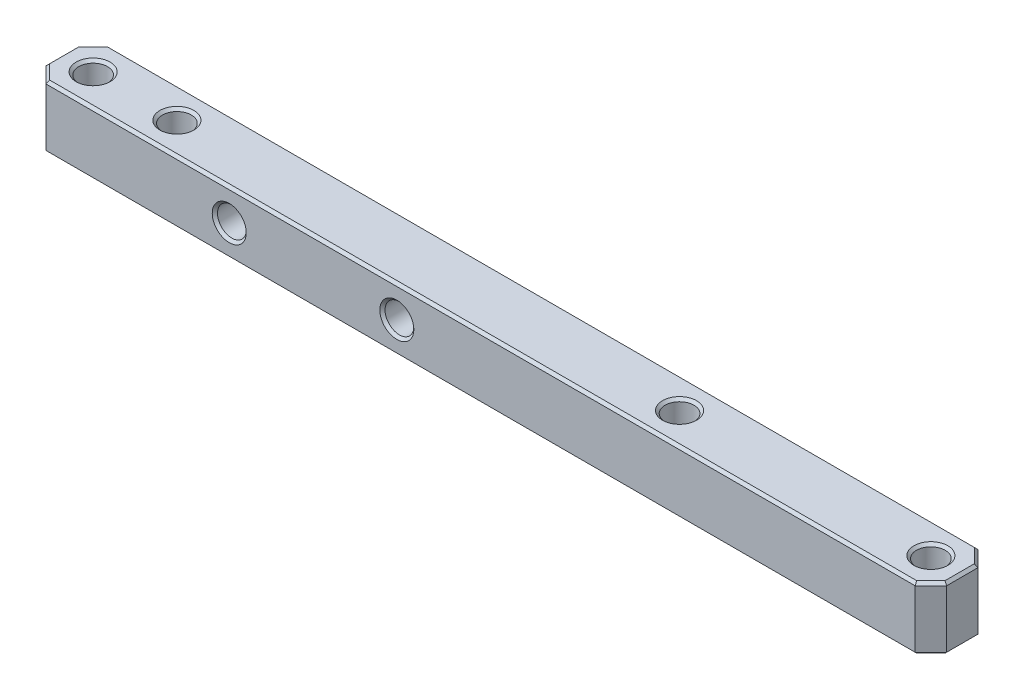
ISO-10303-21;
HEADER;
FILE_DESCRIPTION(('STEP AP214'),'2;1');
FILE_NAME('part.step','',(''),(''),'','','');
FILE_SCHEMA(('AUTOMOTIVE_DESIGN { 1 0 10303 214 1 1 1 1 }'));
ENDSEC;
DATA;
#1=APPLICATION_CONTEXT('core data for automotive mechanical design processes');
#2=APPLICATION_PROTOCOL_DEFINITION('international standard','automotive_design',2000,#1);
#3=PRODUCT_CONTEXT('',#1,'mechanical');
#4=PRODUCT('Part','Part','',(#3));
#5=PRODUCT_RELATED_PRODUCT_CATEGORY('part','',(#4));
#6=PRODUCT_DEFINITION_FORMATION('','',#4);
#7=PRODUCT_DEFINITION_CONTEXT('part definition',#1,'design');
#8=PRODUCT_DEFINITION('design','',#6,#7);
#9=PRODUCT_DEFINITION_SHAPE('','',#8);
#10=(LENGTH_UNIT() NAMED_UNIT(*) SI_UNIT(.MILLI.,.METRE.));
#11=(NAMED_UNIT(*) PLANE_ANGLE_UNIT() SI_UNIT($,.RADIAN.));
#12=(NAMED_UNIT(*) SI_UNIT($,.STERADIAN.) SOLID_ANGLE_UNIT());
#13=UNCERTAINTY_MEASURE_WITH_UNIT(LENGTH_MEASURE(1.E-05),#10,'distance_accuracy_value','');
#14=(GEOMETRIC_REPRESENTATION_CONTEXT(3) GLOBAL_UNCERTAINTY_ASSIGNED_CONTEXT((#13)) GLOBAL_UNIT_ASSIGNED_CONTEXT((#10,
#11,#12)) REPRESENTATION_CONTEXT('',''));
#15=CARTESIAN_POINT('',(0.,0.,0.));
#16=DIRECTION('',(0.,0.,1.));
#17=DIRECTION('',(1.,0.,0.));
#18=AXIS2_PLACEMENT_3D('',#15,#16,#17);
#19=CARTESIAN_POINT('',(0.,9.525,0.));
#20=DIRECTION('',(0.,1.,0.));
#21=DIRECTION('',(0.,0.,1.));
#22=AXIS2_PLACEMENT_3D('',#19,#20,#21);
#23=PLANE('',#22);
#24=CARTESIAN_POINT('',(88.9,9.525,0.));
#25=DIRECTION('',(0.,1.,0.));
#26=DIRECTION('',(0.,0.,1.));
#27=AXIS2_PLACEMENT_3D('',#24,#25,#26);
#28=CIRCLE('',#27,2.57968750000007);
#29=CARTESIAN_POINT('',(88.9,9.525,2.57968750000007));
#30=VERTEX_POINT('',#29);
#31=EDGE_CURVE('E11',#30,#30,#28,.F.);
#32=ORIENTED_EDGE('',*,*,#31,.T.);
#33=EDGE_LOOP('',(#32));
#34=FACE_BOUND('',#33,.T.);
#35=CARTESIAN_POINT('',(12.7,9.525,0.));
#36=DIRECTION('',(0.,1.,0.));
#37=DIRECTION('',(0.,0.,1.));
#38=AXIS2_PLACEMENT_3D('',#35,#36,#37);
#39=CIRCLE('',#38,2.57968750000009);
#40=CARTESIAN_POINT('',(12.7,9.525,2.57968750000009));
#41=VERTEX_POINT('',#40);
#42=EDGE_CURVE('E47',#41,#41,#39,.F.);
#43=ORIENTED_EDGE('',*,*,#42,.T.);
#44=EDGE_LOOP('',(#43));
#45=FACE_BOUND('',#44,.T.);
#46=DIRECTION('',(1.,0.,0.));
#47=VECTOR('',#46,1.);
#48=CARTESIAN_POINT('',(129.38125,9.525,4.36562499999998));
#49=LINE('',#48,#47);
#50=CARTESIAN_POINT('',(-2.21685899243314,9.525,4.36562499999998));
#51=VERTEX_POINT('',#50);
#52=CARTESIAN_POINT('',(129.216858992433,9.525,4.36562499999998));
#53=VERTEX_POINT('',#52);
#54=EDGE_CURVE('E55',#51,#53,#49,.T.);
#55=ORIENTED_EDGE('',*,*,#54,.T.);
#56=DIRECTION('',(0.70710678118655,0.,-0.707106781186545));
#57=VECTOR('',#56,1.);
#58=CARTESIAN_POINT('',(66.7912419962162,9.525,66.7912419962166));
#59=LINE('',#58,#57);
#60=CARTESIAN_POINT('',(131.365625,9.525,2.21685899243319));
#61=VERTEX_POINT('',#60);
#62=EDGE_CURVE('E339',#53,#61,#59,.T.);
#63=ORIENTED_EDGE('',*,*,#62,.T.);
#64=DIRECTION('',(0.,0.,-1.));
#65=VECTOR('',#64,1.);
#66=CARTESIAN_POINT('',(131.365625,9.525,-2.38125));
#67=LINE('',#66,#65);
#68=CARTESIAN_POINT('',(131.365625,9.525,-2.21685899243322));
#69=VERTEX_POINT('',#68);
#70=EDGE_CURVE('E327',#61,#69,#67,.T.);
#71=ORIENTED_EDGE('',*,*,#70,.T.);
#72=DIRECTION('',(-0.707106781186548,0.,-0.707106781186547));
#73=VECTOR('',#72,1.);
#74=CARTESIAN_POINT('',(66.7912419962166,9.525,-66.7912419962166));
#75=LINE('',#74,#73);
#76=CARTESIAN_POINT('',(129.216858992433,9.525,-4.36562499999999));
#77=VERTEX_POINT('',#76);
#78=EDGE_CURVE('E329',#69,#77,#75,.T.);
#79=ORIENTED_EDGE('',*,*,#78,.T.);
#80=DIRECTION('',(-1.,0.,0.));
#81=VECTOR('',#80,1.);
#82=CARTESIAN_POINT('',(-2.38125,9.525,-4.36562499999998));
#83=LINE('',#82,#81);
#84=CARTESIAN_POINT('',(-2.21685899243317,9.525,-4.36562499999998));
#85=VERTEX_POINT('',#84);
#86=EDGE_CURVE('E331',#77,#85,#83,.T.);
#87=ORIENTED_EDGE('',*,*,#86,.T.);
#88=DIRECTION('',(-0.70710678118655,0.,0.707106781186545));
#89=VECTOR('',#88,1.);
#90=CARTESIAN_POINT('',(-3.29124199621657,9.525,-3.29124199621659));
#91=LINE('',#90,#89);
#92=CARTESIAN_POINT('',(-4.36562499999998,9.525,-2.21685899243318));
#93=VERTEX_POINT('',#92);
#94=EDGE_CURVE('E333',#85,#93,#91,.T.);
#95=ORIENTED_EDGE('',*,*,#94,.T.);
#96=DIRECTION('',(0.,0.,1.));
#97=VECTOR('',#96,1.);
#98=CARTESIAN_POINT('',(-4.36562499999998,9.525,2.38124999999997));
#99=LINE('',#98,#97);
#100=CARTESIAN_POINT('',(-4.36562499999998,9.525,2.21685899243314));
#101=VERTEX_POINT('',#100);
#102=EDGE_CURVE('E335',#93,#101,#99,.T.);
#103=ORIENTED_EDGE('',*,*,#102,.T.);
#104=DIRECTION('',(0.707106781186548,0.,0.707106781186547));
#105=VECTOR('',#104,1.);
#106=CARTESIAN_POINT('',(-3.29124199621656,9.525,3.29124199621656));
#107=LINE('',#106,#105);
#108=EDGE_CURVE('E60',#101,#51,#107,.T.);
#109=ORIENTED_EDGE('',*,*,#108,.T.);
#110=EDGE_LOOP('',(#55,#63,#71,#79,#87,#95,#103,#109));
#111=FACE_BOUND('',#110,.T.);
#112=CARTESIAN_POINT('',(0.,9.525,0.));
#113=DIRECTION('',(0.,1.,0.));
#114=DIRECTION('',(0.,0.,1.));
#115=AXIS2_PLACEMENT_3D('',#112,#113,#114);
#116=CIRCLE('',#115,2.57968750000007);
#117=CARTESIAN_POINT('',(0.,9.525,2.57968750000007));
#118=VERTEX_POINT('',#117);
#119=EDGE_CURVE('E324',#118,#118,#116,.F.);
#120=ORIENTED_EDGE('',*,*,#119,.T.);
#121=EDGE_LOOP('',(#120));
#122=FACE_BOUND('',#121,.T.);
#123=CARTESIAN_POINT('',(127.,9.525,0.));
#124=DIRECTION('',(0.,1.,0.));
#125=DIRECTION('',(0.,0.,1.));
#126=AXIS2_PLACEMENT_3D('',#123,#124,#125);
#127=CIRCLE('',#126,2.57968750000007);
#128=CARTESIAN_POINT('',(127.,9.525,2.57968750000007));
#129=VERTEX_POINT('',#128);
#130=EDGE_CURVE('E321',#129,#129,#127,.F.);
#131=ORIENTED_EDGE('',*,*,#130,.T.);
#132=EDGE_LOOP('',(#131));
#133=FACE_BOUND('',#132,.T.);
#134=ADVANCED_FACE('F37',(#34,#45,#111,#122,#133),#23,.T.);
#135=CARTESIAN_POINT('',(0.,0.,0.));
#136=DIRECTION('',(0.,1.,0.));
#137=DIRECTION('',(0.,0.,1.));
#138=AXIS2_PLACEMENT_3D('',#135,#136,#137);
#139=PLANE('',#138);
#140=CARTESIAN_POINT('',(88.9,0.,0.));
#141=DIRECTION('',(0.,1.,0.));
#142=DIRECTION('',(0.,0.,1.));
#143=AXIS2_PLACEMENT_3D('',#140,#141,#142);
#144=CIRCLE('',#143,2.57968749999994);
#145=CARTESIAN_POINT('',(88.9,0.,2.57968749999994));
#146=VERTEX_POINT('',#145);
#147=EDGE_CURVE('E274',#146,#146,#144,.T.);
#148=ORIENTED_EDGE('',*,*,#147,.T.);
#149=EDGE_LOOP('',(#148));
#150=FACE_BOUND('',#149,.T.);
#151=CARTESIAN_POINT('',(127.,0.,0.));
#152=DIRECTION('',(0.,1.,0.));
#153=DIRECTION('',(0.,0.,1.));
#154=AXIS2_PLACEMENT_3D('',#151,#152,#153);
#155=CIRCLE('',#154,2.57968749999994);
#156=CARTESIAN_POINT('',(127.,0.,2.57968749999994));
#157=VERTEX_POINT('',#156);
#158=EDGE_CURVE('E271',#157,#157,#155,.T.);
#159=ORIENTED_EDGE('',*,*,#158,.T.);
#160=EDGE_LOOP('',(#159));
#161=FACE_BOUND('',#160,.T.);
#162=CARTESIAN_POINT('',(12.7,0.,0.));
#163=DIRECTION('',(0.,1.,0.));
#164=DIRECTION('',(0.,0.,1.));
#165=AXIS2_PLACEMENT_3D('',#162,#163,#164);
#166=CIRCLE('',#165,2.57968749999993);
#167=CARTESIAN_POINT('',(12.7,0.,2.57968749999993));
#168=VERTEX_POINT('',#167);
#169=EDGE_CURVE('E268',#168,#168,#166,.T.);
#170=ORIENTED_EDGE('',*,*,#169,.T.);
#171=EDGE_LOOP('',(#170));
#172=FACE_BOUND('',#171,.T.);
#173=CARTESIAN_POINT('',(0.,0.,0.));
#174=DIRECTION('',(0.,1.,0.));
#175=DIRECTION('',(0.,0.,1.));
#176=AXIS2_PLACEMENT_3D('',#173,#174,#175);
#177=CIRCLE('',#176,2.57968749999994);
#178=CARTESIAN_POINT('',(0.,0.,2.57968749999994));
#179=VERTEX_POINT('',#178);
#180=EDGE_CURVE('E265',#179,#179,#177,.T.);
#181=ORIENTED_EDGE('',*,*,#180,.T.);
#182=EDGE_LOOP('',(#181));
#183=FACE_BOUND('',#182,.T.);
#184=DIRECTION('',(0.,0.,-1.));
#185=VECTOR('',#184,1.);
#186=CARTESIAN_POINT('',(-4.36562499999998,0.,0.));
#187=LINE('',#186,#185);
#188=CARTESIAN_POINT('',(-4.36562499999998,0.,2.21685899243314));
#189=VERTEX_POINT('',#188);
#190=CARTESIAN_POINT('',(-4.36562499999998,0.,-2.21685899243319));
#191=VERTEX_POINT('',#190);
#192=EDGE_CURVE('E255',#189,#191,#187,.T.);
#193=ORIENTED_EDGE('',*,*,#192,.T.);
#194=DIRECTION('',(0.70710678118655,0.,-0.707106781186545));
#195=VECTOR('',#194,1.);
#196=CARTESIAN_POINT('',(-2.10061699621658,0.,-4.48186699621658));
#197=LINE('',#196,#195);
#198=CARTESIAN_POINT('',(-2.21685899243317,0.,-4.36562499999998));
#199=VERTEX_POINT('',#198);
#200=EDGE_CURVE('E257',#191,#199,#197,.T.);
#201=ORIENTED_EDGE('',*,*,#200,.T.);
#202=DIRECTION('',(1.,0.,0.));
#203=VECTOR('',#202,1.);
#204=CARTESIAN_POINT('',(0.,0.,-4.36562499999998));
#205=LINE('',#204,#203);
#206=CARTESIAN_POINT('',(129.216858992433,0.,-4.36562499999998));
#207=VERTEX_POINT('',#206);
#208=EDGE_CURVE('E892',#199,#207,#205,.T.);
#209=ORIENTED_EDGE('',*,*,#208,.T.);
#210=DIRECTION('',(0.707106781186548,0.,0.707106781186547));
#211=VECTOR('',#210,1.);
#212=CARTESIAN_POINT('',(131.481866996217,0.,-2.10061699621659));
#213=LINE('',#212,#211);
#214=CARTESIAN_POINT('',(131.365625,0.,-2.21685899243322));
#215=VERTEX_POINT('',#214);
#216=EDGE_CURVE('E895',#207,#215,#213,.T.);
#217=ORIENTED_EDGE('',*,*,#216,.T.);
#218=DIRECTION('',(0.,0.,1.));
#219=VECTOR('',#218,1.);
#220=CARTESIAN_POINT('',(131.365625,0.,0.));
#221=LINE('',#220,#219);
#222=CARTESIAN_POINT('',(131.365625,0.,2.21685899243319));
#223=VERTEX_POINT('',#222);
#224=EDGE_CURVE('E898',#215,#223,#221,.T.);
#225=ORIENTED_EDGE('',*,*,#224,.T.);
#226=DIRECTION('',(-0.70710678118655,0.,0.707106781186545));
#227=VECTOR('',#226,1.);
#228=CARTESIAN_POINT('',(129.100616996217,0.,4.48186699621658));
#229=LINE('',#228,#227);
#230=CARTESIAN_POINT('',(129.216858992433,0.,4.36562499999998));
#231=VERTEX_POINT('',#230);
#232=EDGE_CURVE('E259',#223,#231,#229,.T.);
#233=ORIENTED_EDGE('',*,*,#232,.T.);
#234=DIRECTION('',(-1.,0.,0.));
#235=VECTOR('',#234,1.);
#236=CARTESIAN_POINT('',(0.,0.,4.36562499999998));
#237=LINE('',#236,#235);
#238=CARTESIAN_POINT('',(-2.21685899243314,0.,4.36562499999998));
#239=VERTEX_POINT('',#238);
#240=EDGE_CURVE('E191',#231,#239,#237,.T.);
#241=ORIENTED_EDGE('',*,*,#240,.T.);
#242=DIRECTION('',(-0.707106781186548,0.,-0.707106781186547));
#243=VECTOR('',#242,1.);
#244=CARTESIAN_POINT('',(-4.48186699621658,0.,2.10061699621655));
#245=LINE('',#244,#243);
#246=EDGE_CURVE('E252',#239,#189,#245,.T.);
#247=ORIENTED_EDGE('',*,*,#246,.T.);
#248=EDGE_LOOP('',(#193,#201,#209,#217,#225,#233,#241,#247));
#249=FACE_BOUND('',#248,.T.);
#250=ADVANCED_FACE('F369',(#150,#161,#172,#183,#249),#139,.F.);
#251=CARTESIAN_POINT('',(-4.7625,9.525,-4.7625));
#252=DIRECTION('',(1.,0.,0.));
#253=DIRECTION('',(0.,0.,-1.));
#254=AXIS2_PLACEMENT_3D('',#251,#252,#253);
#255=PLANE('',#254);
#256=DIRECTION('',(0.,-1.,0.));
#257=VECTOR('',#256,1.);
#258=CARTESIAN_POINT('',(-4.7625,9.525,-2.38125000000001));
#259=LINE('',#258,#257);
#260=CARTESIAN_POINT('',(-4.7625,9.12812500000001,-2.38125000000001));
#261=VERTEX_POINT('',#260);
#262=CARTESIAN_POINT('',(-4.7625,0.396875000000005,-2.38125000000001));
#263=VERTEX_POINT('',#262);
#264=EDGE_CURVE('E923',#261,#263,#259,.T.);
#265=ORIENTED_EDGE('',*,*,#264,.T.);
#266=DIRECTION('',(0.,0.,1.));
#267=VECTOR('',#266,1.);
#268=CARTESIAN_POINT('',(-4.7625,0.396875000000005,-4.7625));
#269=LINE('',#268,#267);
#270=CARTESIAN_POINT('',(-4.7625,0.396875000000005,2.38124999999997));
#271=VERTEX_POINT('',#270);
#272=EDGE_CURVE('E308',#263,#271,#269,.T.);
#273=ORIENTED_EDGE('',*,*,#272,.T.);
#274=DIRECTION('',(0.,1.,0.));
#275=VECTOR('',#274,1.);
#276=CARTESIAN_POINT('',(-4.7625,9.525,2.38124999999997));
#277=LINE('',#276,#275);
#278=CARTESIAN_POINT('',(-4.7625,9.12812500000001,2.38124999999997));
#279=VERTEX_POINT('',#278);
#280=EDGE_CURVE('E176',#271,#279,#277,.T.);
#281=ORIENTED_EDGE('',*,*,#280,.T.);
#282=DIRECTION('',(0.,0.,-1.));
#283=VECTOR('',#282,1.);
#284=CARTESIAN_POINT('',(-4.7625,9.12812500000001,-2.38125000000002));
#285=LINE('',#284,#283);
#286=EDGE_CURVE('E306',#279,#261,#285,.T.);
#287=ORIENTED_EDGE('',*,*,#286,.T.);
#288=EDGE_LOOP('',(#265,#273,#281,#287));
#289=FACE_BOUND('',#288,.T.);
#290=ADVANCED_FACE('F375',(#289),#255,.F.);
#291=CARTESIAN_POINT('',(-4.7625,9.525,4.7625));
#292=DIRECTION('',(0.,0.,-1.));
#293=DIRECTION('',(-1.,0.,0.));
#294=AXIS2_PLACEMENT_3D('',#291,#292,#293);
#295=PLANE('',#294);
#296=CARTESIAN_POINT('',(25.4,4.7625,4.7625));
#297=DIRECTION('',(0.,0.,-1.));
#298=DIRECTION('',(-1.,0.,0.));
#299=AXIS2_PLACEMENT_3D('',#296,#297,#298);
#300=CIRCLE('',#299,2.57968749999994);
#301=CARTESIAN_POINT('',(22.8203125000001,4.7625,4.7625));
#302=VERTEX_POINT('',#301);
#303=EDGE_CURVE('E928',#302,#302,#300,.T.);
#304=ORIENTED_EDGE('',*,*,#303,.T.);
#305=EDGE_LOOP('',(#304));
#306=FACE_BOUND('',#305,.T.);
#307=CARTESIAN_POINT('',(50.8,4.7625,4.7625));
#308=DIRECTION('',(0.,0.,-1.));
#309=DIRECTION('',(-1.,0.,0.));
#310=AXIS2_PLACEMENT_3D('',#307,#308,#309);
#311=CIRCLE('',#310,2.57968749999996);
#312=CARTESIAN_POINT('',(48.2203125,4.7625,4.7625));
#313=VERTEX_POINT('',#312);
#314=EDGE_CURVE('E164',#313,#313,#311,.T.);
#315=ORIENTED_EDGE('',*,*,#314,.T.);
#316=EDGE_LOOP('',(#315));
#317=FACE_BOUND('',#316,.T.);
#318=DIRECTION('',(0.,-1.,0.));
#319=VECTOR('',#318,1.);
#320=CARTESIAN_POINT('',(-2.38124999999997,9.525,4.7625));
#321=LINE('',#320,#319);
#322=CARTESIAN_POINT('',(-2.38124999999997,9.12812500000001,4.7625));
#323=VERTEX_POINT('',#322);
#324=CARTESIAN_POINT('',(-2.38124999999997,0.396875000000005,4.7625));
#325=VERTEX_POINT('',#324);
#326=EDGE_CURVE('E159',#323,#325,#321,.T.);
#327=ORIENTED_EDGE('',*,*,#326,.T.);
#328=DIRECTION('',(1.,0.,0.));
#329=VECTOR('',#328,1.);
#330=CARTESIAN_POINT('',(-4.7625,0.396875000000005,4.7625));
#331=LINE('',#330,#329);
#332=CARTESIAN_POINT('',(129.38125,0.396875000000008,4.7625));
#333=VERTEX_POINT('',#332);
#334=EDGE_CURVE('E154',#325,#333,#331,.T.);
#335=ORIENTED_EDGE('',*,*,#334,.T.);
#336=DIRECTION('',(0.,1.,0.));
#337=VECTOR('',#336,1.);
#338=CARTESIAN_POINT('',(129.38125,9.525,4.7625));
#339=LINE('',#338,#337);
#340=CARTESIAN_POINT('',(129.38125,9.12812500000001,4.7625));
#341=VERTEX_POINT('',#340);
#342=EDGE_CURVE('E157',#333,#341,#339,.T.);
#343=ORIENTED_EDGE('',*,*,#342,.T.);
#344=DIRECTION('',(-1.,0.,0.));
#345=VECTOR('',#344,1.);
#346=CARTESIAN_POINT('',(-2.38124999999997,9.12812500000001,4.7625));
#347=LINE('',#346,#345);
#348=EDGE_CURVE('E165',#341,#323,#347,.T.);
#349=ORIENTED_EDGE('',*,*,#348,.T.);
#350=EDGE_LOOP('',(#327,#335,#343,#349));
#351=FACE_BOUND('',#350,.T.);
#352=ADVANCED_FACE('F156',(#306,#317,#351),#295,.F.);
#353=CARTESIAN_POINT('',(131.7625,9.525,-4.7625));
#354=DIRECTION('',(-1.,0.,0.));
#355=DIRECTION('',(0.,0.,1.));
#356=AXIS2_PLACEMENT_3D('',#353,#354,#355);
#357=PLANE('',#356);
#358=DIRECTION('',(0.,-1.,0.));
#359=VECTOR('',#358,1.);
#360=CARTESIAN_POINT('',(131.7625,9.525,2.38125000000001));
#361=LINE('',#360,#359);
#362=CARTESIAN_POINT('',(131.7625,9.12812500000001,2.38125000000001));
#363=VERTEX_POINT('',#362);
#364=CARTESIAN_POINT('',(131.7625,0.396875000000005,2.38125000000001));
#365=VERTEX_POINT('',#364);
#366=EDGE_CURVE('E912',#363,#365,#361,.T.);
#367=ORIENTED_EDGE('',*,*,#366,.T.);
#368=DIRECTION('',(0.,0.,-1.));
#369=VECTOR('',#368,1.);
#370=CARTESIAN_POINT('',(131.7625,0.396875000000005,-4.7625));
#371=LINE('',#370,#369);
#372=CARTESIAN_POINT('',(131.7625,0.396874999999998,-2.38125));
#373=VERTEX_POINT('',#372);
#374=EDGE_CURVE('E315',#365,#373,#371,.T.);
#375=ORIENTED_EDGE('',*,*,#374,.T.);
#376=DIRECTION('',(0.,1.,0.));
#377=VECTOR('',#376,1.);
#378=CARTESIAN_POINT('',(131.7625,9.525,-2.38125));
#379=LINE('',#378,#377);
#380=CARTESIAN_POINT('',(131.7625,9.12812500000001,-2.38125));
#381=VERTEX_POINT('',#380);
#382=EDGE_CURVE('E910',#373,#381,#379,.T.);
#383=ORIENTED_EDGE('',*,*,#382,.T.);
#384=DIRECTION('',(0.,0.,1.));
#385=VECTOR('',#384,1.);
#386=CARTESIAN_POINT('',(131.7625,9.12812500000001,2.38125000000001));
#387=LINE('',#386,#385);
#388=EDGE_CURVE('E188',#381,#363,#387,.T.);
#389=ORIENTED_EDGE('',*,*,#388,.T.);
#390=EDGE_LOOP('',(#367,#375,#383,#389));
#391=FACE_BOUND('',#390,.T.);
#392=ADVANCED_FACE('F381',(#391),#357,.F.);
#393=CARTESIAN_POINT('',(-4.7625,9.525,-4.7625));
#394=DIRECTION('',(0.,0.,1.));
#395=DIRECTION('',(1.,0.,0.));
#396=AXIS2_PLACEMENT_3D('',#393,#394,#395);
#397=PLANE('',#396);
#398=CARTESIAN_POINT('',(25.4,4.7625,-4.7625));
#399=DIRECTION('',(0.,0.,1.));
#400=DIRECTION('',(1.,0.,0.));
#401=AXIS2_PLACEMENT_3D('',#398,#399,#400);
#402=CIRCLE('',#401,2.5796875);
#403=CARTESIAN_POINT('',(27.9796875,4.7625,-4.7625));
#404=VERTEX_POINT('',#403);
#405=EDGE_CURVE('E943',#404,#404,#402,.T.);
#406=ORIENTED_EDGE('',*,*,#405,.T.);
#407=EDGE_LOOP('',(#406));
#408=FACE_BOUND('',#407,.T.);
#409=CARTESIAN_POINT('',(50.8,4.7625,-4.7625));
#410=DIRECTION('',(0.,0.,1.));
#411=DIRECTION('',(1.,0.,0.));
#412=AXIS2_PLACEMENT_3D('',#409,#410,#411);
#413=CIRCLE('',#412,2.57968749999996);
#414=CARTESIAN_POINT('',(53.3796875,4.7625,-4.7625));
#415=VERTEX_POINT('',#414);
#416=EDGE_CURVE('E940',#415,#415,#413,.T.);
#417=ORIENTED_EDGE('',*,*,#416,.T.);
#418=EDGE_LOOP('',(#417));
#419=FACE_BOUND('',#418,.T.);
#420=DIRECTION('',(0.,-1.,0.));
#421=VECTOR('',#420,1.);
#422=CARTESIAN_POINT('',(129.38125,9.525,-4.7625));
#423=LINE('',#422,#421);
#424=CARTESIAN_POINT('',(129.38125,9.12812500000002,-4.7625));
#425=VERTEX_POINT('',#424);
#426=CARTESIAN_POINT('',(129.38125,0.396875000000005,-4.7625));
#427=VERTEX_POINT('',#426);
#428=EDGE_CURVE('E195',#425,#427,#423,.T.);
#429=ORIENTED_EDGE('',*,*,#428,.T.);
#430=DIRECTION('',(-1.,0.,0.));
#431=VECTOR('',#430,1.);
#432=CARTESIAN_POINT('',(-4.7625,0.396875000000005,-4.7625));
#433=LINE('',#432,#431);
#434=CARTESIAN_POINT('',(-2.38125,0.396875000000005,-4.7625));
#435=VERTEX_POINT('',#434);
#436=EDGE_CURVE('E891',#427,#435,#433,.T.);
#437=ORIENTED_EDGE('',*,*,#436,.T.);
#438=DIRECTION('',(0.,1.,0.));
#439=VECTOR('',#438,1.);
#440=CARTESIAN_POINT('',(-2.38125,9.525,-4.7625));
#441=LINE('',#440,#439);
#442=CARTESIAN_POINT('',(-2.38125,9.12812500000001,-4.7625));
#443=VERTEX_POINT('',#442);
#444=EDGE_CURVE('E192',#435,#443,#441,.T.);
#445=ORIENTED_EDGE('',*,*,#444,.T.);
#446=DIRECTION('',(1.,0.,0.));
#447=VECTOR('',#446,1.);
#448=CARTESIAN_POINT('',(129.38125,9.12812500000001,-4.7625));
#449=LINE('',#448,#447);
#450=EDGE_CURVE('E937',#443,#425,#449,.T.);
#451=ORIENTED_EDGE('',*,*,#450,.T.);
#452=EDGE_LOOP('',(#429,#437,#445,#451));
#453=FACE_BOUND('',#452,.T.);
#454=ADVANCED_FACE('F365',(#408,#419,#453),#397,.F.);
#455=CARTESIAN_POINT('',(0.,9.525,0.));
#456=DIRECTION('',(0.,-1.,0.));
#457=DIRECTION('',(0.,0.,-1.));
#458=AXIS2_PLACEMENT_3D('',#455,#456,#457);
#459=CYLINDRICAL_SURFACE('',#458,2.1828125);
#460=CARTESIAN_POINT('',(0.,0.396874999999939,0.));
#461=DIRECTION('',(0.,1.,0.));
#462=DIRECTION('',(0.,0.,1.));
#463=AXIS2_PLACEMENT_3D('',#460,#461,#462);
#464=CIRCLE('',#463,2.1828125);
#465=CARTESIAN_POINT('',(0.,0.396874999999939,2.1828125));
#466=VERTEX_POINT('',#465);
#467=EDGE_CURVE('E298',#466,#466,#464,.F.);
#468=ORIENTED_EDGE('',*,*,#467,.T.);
#469=EDGE_LOOP('',(#468));
#470=FACE_BOUND('',#469,.T.);
#471=CARTESIAN_POINT('',(0.,9.12812499999995,0.));
#472=DIRECTION('',(0.,1.,0.));
#473=DIRECTION('',(0.,0.,1.));
#474=AXIS2_PLACEMENT_3D('',#471,#472,#473);
#475=CIRCLE('',#474,2.1828125);
#476=CARTESIAN_POINT('',(0.,9.12812499999995,2.1828125));
#477=VERTEX_POINT('',#476);
#478=EDGE_CURVE('E295',#477,#477,#475,.T.);
#479=ORIENTED_EDGE('',*,*,#478,.T.);
#480=EDGE_LOOP('',(#479));
#481=FACE_BOUND('',#480,.T.);
#482=ADVANCED_FACE('F355',(#470,#481),#459,.F.);
#483=CARTESIAN_POINT('',(12.7,9.525,0.));
#484=DIRECTION('',(0.,-1.,0.));
#485=DIRECTION('',(0.,0.,-1.));
#486=AXIS2_PLACEMENT_3D('',#483,#484,#485);
#487=CYLINDRICAL_SURFACE('',#486,2.1828125);
#488=CARTESIAN_POINT('',(12.7,0.396874999999939,0.));
#489=DIRECTION('',(0.,1.,0.));
#490=DIRECTION('',(0.,0.,1.));
#491=AXIS2_PLACEMENT_3D('',#488,#489,#490);
#492=CIRCLE('',#491,2.1828125);
#493=CARTESIAN_POINT('',(12.7,0.396874999999939,2.1828125));
#494=VERTEX_POINT('',#493);
#495=EDGE_CURVE('E292',#494,#494,#492,.F.);
#496=ORIENTED_EDGE('',*,*,#495,.T.);
#497=EDGE_LOOP('',(#496));
#498=FACE_BOUND('',#497,.T.);
#499=CARTESIAN_POINT('',(12.7,9.12812499999991,0.));
#500=DIRECTION('',(0.,1.,0.));
#501=DIRECTION('',(0.,0.,1.));
#502=AXIS2_PLACEMENT_3D('',#499,#500,#501);
#503=CIRCLE('',#502,2.1828125);
#504=CARTESIAN_POINT('',(12.7,9.12812499999991,2.1828125));
#505=VERTEX_POINT('',#504);
#506=EDGE_CURVE('E289',#505,#505,#503,.T.);
#507=ORIENTED_EDGE('',*,*,#506,.T.);
#508=EDGE_LOOP('',(#507));
#509=FACE_BOUND('',#508,.T.);
#510=ADVANCED_FACE('F352',(#498,#509),#487,.F.);
#511=CARTESIAN_POINT('',(127.,9.525,0.));
#512=DIRECTION('',(0.,-1.,0.));
#513=DIRECTION('',(0.,0.,-1.));
#514=AXIS2_PLACEMENT_3D('',#511,#512,#513);
#515=CYLINDRICAL_SURFACE('',#514,2.1828125);
#516=CARTESIAN_POINT('',(127.,0.396874999999939,0.));
#517=DIRECTION('',(0.,1.,0.));
#518=DIRECTION('',(0.,0.,1.));
#519=AXIS2_PLACEMENT_3D('',#516,#517,#518);
#520=CIRCLE('',#519,2.1828125);
#521=CARTESIAN_POINT('',(127.,0.396874999999939,2.1828125));
#522=VERTEX_POINT('',#521);
#523=EDGE_CURVE('E286',#522,#522,#520,.F.);
#524=ORIENTED_EDGE('',*,*,#523,.T.);
#525=EDGE_LOOP('',(#524));
#526=FACE_BOUND('',#525,.T.);
#527=CARTESIAN_POINT('',(127.,9.12812499999995,0.));
#528=DIRECTION('',(0.,1.,0.));
#529=DIRECTION('',(0.,0.,1.));
#530=AXIS2_PLACEMENT_3D('',#527,#528,#529);
#531=CIRCLE('',#530,2.1828125);
#532=CARTESIAN_POINT('',(127.,9.12812499999995,2.1828125));
#533=VERTEX_POINT('',#532);
#534=EDGE_CURVE('E283',#533,#533,#531,.T.);
#535=ORIENTED_EDGE('',*,*,#534,.T.);
#536=EDGE_LOOP('',(#535));
#537=FACE_BOUND('',#536,.T.);
#538=ADVANCED_FACE('F354',(#526,#537),#515,.F.);
#539=CARTESIAN_POINT('',(88.9,9.525,0.));
#540=DIRECTION('',(0.,-1.,0.));
#541=DIRECTION('',(0.,0.,-1.));
#542=AXIS2_PLACEMENT_3D('',#539,#540,#541);
#543=CYLINDRICAL_SURFACE('',#542,2.1828125);
#544=CARTESIAN_POINT('',(88.9,0.396874999999939,0.));
#545=DIRECTION('',(0.,1.,0.));
#546=DIRECTION('',(0.,0.,1.));
#547=AXIS2_PLACEMENT_3D('',#544,#545,#546);
#548=CIRCLE('',#547,2.1828125);
#549=CARTESIAN_POINT('',(88.9,0.396874999999939,2.1828125));
#550=VERTEX_POINT('',#549);
#551=EDGE_CURVE('E280',#550,#550,#548,.F.);
#552=ORIENTED_EDGE('',*,*,#551,.T.);
#553=EDGE_LOOP('',(#552));
#554=FACE_BOUND('',#553,.T.);
#555=CARTESIAN_POINT('',(88.9,9.12812499999995,0.));
#556=DIRECTION('',(0.,1.,0.));
#557=DIRECTION('',(0.,0.,1.));
#558=AXIS2_PLACEMENT_3D('',#555,#556,#557);
#559=CIRCLE('',#558,2.1828125);
#560=CARTESIAN_POINT('',(88.9,9.12812499999995,2.1828125));
#561=VERTEX_POINT('',#560);
#562=EDGE_CURVE('E277',#561,#561,#559,.T.);
#563=ORIENTED_EDGE('',*,*,#562,.T.);
#564=EDGE_LOOP('',(#563));
#565=FACE_BOUND('',#564,.T.);
#566=ADVANCED_FACE('F362',(#554,#565),#543,.F.);
#567=CARTESIAN_POINT('',(50.8,4.7625,-4.7625));
#568=DIRECTION('',(0.,0.,1.));
#569=DIRECTION('',(1.,0.,0.));
#570=AXIS2_PLACEMENT_3D('',#567,#568,#569);
#571=CYLINDRICAL_SURFACE('',#570,2.1828125);
#572=CARTESIAN_POINT('',(50.8,4.7625,4.36562500000005));
#573=DIRECTION('',(0.,0.,-1.));
#574=DIRECTION('',(-1.,0.,0.));
#575=AXIS2_PLACEMENT_3D('',#572,#573,#574);
#576=CIRCLE('',#575,2.1828125);
#577=CARTESIAN_POINT('',(48.6171875,4.7625,4.36562500000005));
#578=VERTEX_POINT('',#577);
#579=EDGE_CURVE('E896',#578,#578,#576,.F.);
#580=ORIENTED_EDGE('',*,*,#579,.T.);
#581=EDGE_LOOP('',(#580));
#582=FACE_BOUND('',#581,.T.);
#583=CARTESIAN_POINT('',(50.8,4.7625,-4.36562500000005));
#584=DIRECTION('',(0.,0.,1.));
#585=DIRECTION('',(1.,0.,0.));
#586=AXIS2_PLACEMENT_3D('',#583,#584,#585);
#587=CIRCLE('',#586,2.1828125);
#588=CARTESIAN_POINT('',(52.9828125,4.7625,-4.36562500000005));
#589=VERTEX_POINT('',#588);
#590=EDGE_CURVE('E901',#589,#589,#587,.F.);
#591=ORIENTED_EDGE('',*,*,#590,.T.);
#592=EDGE_LOOP('',(#591));
#593=FACE_BOUND('',#592,.T.);
#594=ADVANCED_FACE('F800',(#582,#593),#571,.F.);
#595=CARTESIAN_POINT('',(25.4,4.7625,-4.7625));
#596=DIRECTION('',(0.,0.,1.));
#597=DIRECTION('',(1.,0.,0.));
#598=AXIS2_PLACEMENT_3D('',#595,#596,#597);
#599=CYLINDRICAL_SURFACE('',#598,2.1828125);
#600=CARTESIAN_POINT('',(25.4,4.7625,4.36562500000003));
#601=DIRECTION('',(0.,0.,-1.));
#602=DIRECTION('',(-1.,0.,0.));
#603=AXIS2_PLACEMENT_3D('',#600,#601,#602);
#604=CIRCLE('',#603,2.1828125);
#605=CARTESIAN_POINT('',(23.2171875,4.7625,4.36562500000003));
#606=VERTEX_POINT('',#605);
#607=EDGE_CURVE('E934',#606,#606,#604,.F.);
#608=ORIENTED_EDGE('',*,*,#607,.T.);
#609=EDGE_LOOP('',(#608));
#610=FACE_BOUND('',#609,.T.);
#611=CARTESIAN_POINT('',(25.4,4.7625,-4.36562500000001));
#612=DIRECTION('',(0.,0.,1.));
#613=DIRECTION('',(1.,0.,0.));
#614=AXIS2_PLACEMENT_3D('',#611,#612,#613);
#615=CIRCLE('',#614,2.1828125);
#616=CARTESIAN_POINT('',(27.5828125,4.7625,-4.36562500000001));
#617=VERTEX_POINT('',#616);
#618=EDGE_CURVE('E931',#617,#617,#615,.F.);
#619=ORIENTED_EDGE('',*,*,#618,.T.);
#620=EDGE_LOOP('',(#619));
#621=FACE_BOUND('',#620,.T.);
#622=ADVANCED_FACE('F399',(#610,#621),#599,.F.);
#623=CARTESIAN_POINT('',(129.38125,9.525,-4.7625));
#624=DIRECTION('',(-0.707106781186547,0.,0.707106781186548));
#625=DIRECTION('',(0.,-1.,0.));
#626=AXIS2_PLACEMENT_3D('',#623,#624,#625);
#627=PLANE('',#626);
#628=ORIENTED_EDGE('',*,*,#382,.F.);
#629=DIRECTION('',(0.707106781186548,0.,0.707106781186547));
#630=VECTOR('',#629,1.);
#631=CARTESIAN_POINT('',(129.38125,0.396874999999998,-4.7625));
#632=LINE('',#631,#630);
#633=EDGE_CURVE('E319',#373,#427,#632,.F.);
#634=ORIENTED_EDGE('',*,*,#633,.T.);
#635=ORIENTED_EDGE('',*,*,#428,.F.);
#636=DIRECTION('',(-0.707106781186548,0.,-0.707106781186547));
#637=VECTOR('',#636,1.);
#638=CARTESIAN_POINT('',(129.38125,9.12812500000002,-4.7625));
#639=LINE('',#638,#637);
#640=EDGE_CURVE('E317',#425,#381,#639,.F.);
#641=ORIENTED_EDGE('',*,*,#640,.T.);
#642=EDGE_LOOP('',(#628,#634,#635,#641));
#643=FACE_BOUND('',#642,.T.);
#644=ADVANCED_FACE('F393',(#643),#627,.F.);
#645=CARTESIAN_POINT('',(131.7625,9.525,2.38125000000001));
#646=DIRECTION('',(-0.707106781186545,0.,-0.70710678118655));
#647=DIRECTION('',(0.,-1.,0.));
#648=AXIS2_PLACEMENT_3D('',#645,#646,#647);
#649=PLANE('',#648);
#650=ORIENTED_EDGE('',*,*,#342,.F.);
#651=DIRECTION('',(-0.70710678118655,0.,0.707106781186545));
#652=VECTOR('',#651,1.);
#653=CARTESIAN_POINT('',(131.7625,0.396875000000009,2.38125000000001));
#654=LINE('',#653,#652);
#655=EDGE_CURVE('E172',#333,#365,#654,.F.);
#656=ORIENTED_EDGE('',*,*,#655,.T.);
#657=ORIENTED_EDGE('',*,*,#366,.F.);
#658=DIRECTION('',(0.70710678118655,0.,-0.707106781186545));
#659=VECTOR('',#658,1.);
#660=CARTESIAN_POINT('',(131.7625,9.12812500000001,2.38125000000001));
#661=LINE('',#660,#659);
#662=EDGE_CURVE('E175',#363,#341,#661,.F.);
#663=ORIENTED_EDGE('',*,*,#662,.T.);
#664=EDGE_LOOP('',(#650,#656,#657,#663));
#665=FACE_BOUND('',#664,.T.);
#666=ADVANCED_FACE('F170',(#665),#649,.F.);
#667=CARTESIAN_POINT('',(-4.7625,9.525,-2.38125000000001));
#668=DIRECTION('',(0.707106781186545,0.,0.70710678118655));
#669=DIRECTION('',(0.,-1.,0.));
#670=AXIS2_PLACEMENT_3D('',#667,#668,#669);
#671=PLANE('',#670);
#672=ORIENTED_EDGE('',*,*,#444,.F.);
#673=DIRECTION('',(0.70710678118655,0.,-0.707106781186545));
#674=VECTOR('',#673,1.);
#675=CARTESIAN_POINT('',(-4.7625,0.396875000000005,-2.38125000000001));
#676=LINE('',#675,#674);
#677=EDGE_CURVE('E303',#435,#263,#676,.F.);
#678=ORIENTED_EDGE('',*,*,#677,.T.);
#679=ORIENTED_EDGE('',*,*,#264,.F.);
#680=DIRECTION('',(-0.70710678118655,0.,0.707106781186545));
#681=VECTOR('',#680,1.);
#682=CARTESIAN_POINT('',(-4.7625,9.12812500000001,-2.38125000000001));
#683=LINE('',#682,#681);
#684=EDGE_CURVE('E301',#261,#443,#683,.F.);
#685=ORIENTED_EDGE('',*,*,#684,.T.);
#686=EDGE_LOOP('',(#672,#678,#679,#685));
#687=FACE_BOUND('',#686,.T.);
#688=ADVANCED_FACE('F406',(#687),#671,.F.);
#689=CARTESIAN_POINT('',(-2.38124999999997,9.525,4.7625));
#690=DIRECTION('',(0.707106781186547,0.,-0.707106781186548));
#691=DIRECTION('',(0.,-1.,0.));
#692=AXIS2_PLACEMENT_3D('',#689,#690,#691);
#693=PLANE('',#692);
#694=ORIENTED_EDGE('',*,*,#280,.F.);
#695=DIRECTION('',(-0.707106781186548,0.,-0.707106781186547));
#696=VECTOR('',#695,1.);
#697=CARTESIAN_POINT('',(-2.38124999999997,0.396875000000005,4.7625));
#698=LINE('',#697,#696);
#699=EDGE_CURVE('E251',#271,#325,#698,.F.);
#700=ORIENTED_EDGE('',*,*,#699,.T.);
#701=ORIENTED_EDGE('',*,*,#326,.F.);
#702=DIRECTION('',(0.707106781186548,0.,0.707106781186547));
#703=VECTOR('',#702,1.);
#704=CARTESIAN_POINT('',(-2.38124999999997,9.12812500000001,4.7625));
#705=LINE('',#704,#703);
#706=EDGE_CURVE('E310',#323,#279,#705,.F.);
#707=ORIENTED_EDGE('',*,*,#706,.T.);
#708=EDGE_LOOP('',(#694,#700,#701,#707));
#709=FACE_BOUND('',#708,.T.);
#710=ADVANCED_FACE('F412',(#709),#693,.F.);
#711=CARTESIAN_POINT('',(25.4,4.7625,4.7625));
#712=DIRECTION('',(0.,0.,1.));
#713=DIRECTION('',(1.,0.,0.));
#714=AXIS2_PLACEMENT_3D('',#711,#712,#713);
#715=CONICAL_SURFACE('',#714,2.57968749999994,0.785398163397418);
#716=ORIENTED_EDGE('',*,*,#607,.F.);
#717=EDGE_LOOP('',(#716));
#718=FACE_BOUND('',#717,.T.);
#719=ORIENTED_EDGE('',*,*,#303,.F.);
#720=EDGE_LOOP('',(#719));
#721=FACE_BOUND('',#720,.T.);
#722=ADVANCED_FACE('F419',(#718,#721),#715,.F.);
#723=CARTESIAN_POINT('',(25.4,4.7625,-4.7625));
#724=DIRECTION('',(0.,0.,-1.));
#725=DIRECTION('',(-1.,0.,0.));
#726=AXIS2_PLACEMENT_3D('',#723,#724,#725);
#727=CONICAL_SURFACE('',#726,2.5796875,0.785398163397458);
#728=ORIENTED_EDGE('',*,*,#618,.F.);
#729=EDGE_LOOP('',(#728));
#730=FACE_BOUND('',#729,.T.);
#731=ORIENTED_EDGE('',*,*,#405,.F.);
#732=EDGE_LOOP('',(#731));
#733=FACE_BOUND('',#732,.T.);
#734=ADVANCED_FACE('F426',(#730,#733),#727,.F.);
#735=CARTESIAN_POINT('',(50.8,4.7625,4.7625));
#736=DIRECTION('',(0.,0.,1.));
#737=DIRECTION('',(1.,0.,0.));
#738=AXIS2_PLACEMENT_3D('',#735,#736,#737);
#739=CONICAL_SURFACE('',#738,2.57968749999996,0.785398163397458);
#740=ORIENTED_EDGE('',*,*,#579,.F.);
#741=EDGE_LOOP('',(#740));
#742=FACE_BOUND('',#741,.T.);
#743=ORIENTED_EDGE('',*,*,#314,.F.);
#744=EDGE_LOOP('',(#743));
#745=FACE_BOUND('',#744,.T.);
#746=ADVANCED_FACE('F433',(#742,#745),#739,.F.);
#747=CARTESIAN_POINT('',(50.8,4.7625,-4.7625));
#748=DIRECTION('',(0.,0.,-1.));
#749=DIRECTION('',(-1.,0.,0.));
#750=AXIS2_PLACEMENT_3D('',#747,#748,#749);
#751=CONICAL_SURFACE('',#750,2.57968749999996,0.785398163397458);
#752=ORIENTED_EDGE('',*,*,#590,.F.);
#753=EDGE_LOOP('',(#752));
#754=FACE_BOUND('',#753,.T.);
#755=ORIENTED_EDGE('',*,*,#416,.F.);
#756=EDGE_LOOP('',(#755));
#757=FACE_BOUND('',#756,.T.);
#758=ADVANCED_FACE('F440',(#754,#757),#751,.F.);
#759=CARTESIAN_POINT('',(88.9,0.,0.));
#760=DIRECTION('',(0.,-1.,0.));
#761=DIRECTION('',(0.,0.,-1.));
#762=AXIS2_PLACEMENT_3D('',#759,#760,#761);
#763=CONICAL_SURFACE('',#762,2.57968749999994,0.785398163397451);
#764=ORIENTED_EDGE('',*,*,#551,.F.);
#765=EDGE_LOOP('',(#764));
#766=FACE_BOUND('',#765,.T.);
#767=ORIENTED_EDGE('',*,*,#147,.F.);
#768=EDGE_LOOP('',(#767));
#769=FACE_BOUND('',#768,.T.);
#770=ADVANCED_FACE('F447',(#766,#769),#763,.F.);
#771=CARTESIAN_POINT('',(127.,0.,0.));
#772=DIRECTION('',(0.,-1.,0.));
#773=DIRECTION('',(0.,0.,-1.));
#774=AXIS2_PLACEMENT_3D('',#771,#772,#773);
#775=CONICAL_SURFACE('',#774,2.57968749999994,0.785398163397452);
#776=ORIENTED_EDGE('',*,*,#523,.F.);
#777=EDGE_LOOP('',(#776));
#778=FACE_BOUND('',#777,.T.);
#779=ORIENTED_EDGE('',*,*,#158,.F.);
#780=EDGE_LOOP('',(#779));
#781=FACE_BOUND('',#780,.T.);
#782=ADVANCED_FACE('F454',(#778,#781),#775,.F.);
#783=CARTESIAN_POINT('',(12.7,0.,0.));
#784=DIRECTION('',(0.,-1.,0.));
#785=DIRECTION('',(0.,0.,-1.));
#786=AXIS2_PLACEMENT_3D('',#783,#784,#785);
#787=CONICAL_SURFACE('',#786,2.57968749999993,0.785398163397435);
#788=ORIENTED_EDGE('',*,*,#495,.F.);
#789=EDGE_LOOP('',(#788));
#790=FACE_BOUND('',#789,.T.);
#791=ORIENTED_EDGE('',*,*,#169,.F.);
#792=EDGE_LOOP('',(#791));
#793=FACE_BOUND('',#792,.T.);
#794=ADVANCED_FACE('F461',(#790,#793),#787,.F.);
#795=CARTESIAN_POINT('',(0.,0.,0.));
#796=DIRECTION('',(0.,-1.,0.));
#797=DIRECTION('',(0.,0.,-1.));
#798=AXIS2_PLACEMENT_3D('',#795,#796,#797);
#799=CONICAL_SURFACE('',#798,2.57968749999994,0.785398163397451);
#800=ORIENTED_EDGE('',*,*,#467,.F.);
#801=EDGE_LOOP('',(#800));
#802=FACE_BOUND('',#801,.T.);
#803=ORIENTED_EDGE('',*,*,#180,.F.);
#804=EDGE_LOOP('',(#803));
#805=FACE_BOUND('',#804,.T.);
#806=ADVANCED_FACE('F468',(#802,#805),#799,.F.);
#807=CARTESIAN_POINT('',(66.7912419962162,0.,66.7912419962166));
#808=DIRECTION('',(-0.499999999999994,0.707106781186554,-0.499999999999997));
#809=DIRECTION('',(-0.70710678118655,0.,0.707106781186545));
#810=AXIS2_PLACEMENT_3D('',#807,#808,#809);
#811=PLANE('',#810);
#812=DIRECTION('',(-0.678598344545861,-0.678598344545837,-0.281084637714811));
#813=VECTOR('',#812,1.);
#814=CARTESIAN_POINT('',(130.399875623023,-0.965749376976893,1.81683250263599));
#815=LINE('',#814,#813);
#816=EDGE_CURVE('E186',#365,#223,#815,.T.);
#817=ORIENTED_EDGE('',*,*,#816,.F.);
#818=ORIENTED_EDGE('',*,*,#655,.F.);
#819=DIRECTION('',(-0.281084637714808,-0.678598344545838,-0.678598344545861));
#820=VECTOR('',#819,1.);
#821=CARTESIAN_POINT('',(136.191985074738,16.8394439871621,21.2050689871627));
#822=LINE('',#821,#820);
#823=EDGE_CURVE('E183',#231,#333,#822,.F.);
#824=ORIENTED_EDGE('',*,*,#823,.F.);
#825=ORIENTED_EDGE('',*,*,#232,.F.);
#826=EDGE_LOOP('',(#817,#818,#824,#825));
#827=FACE_BOUND('',#826,.T.);
#828=ADVANCED_FACE('F181',(#827),#811,.F.);
#829=CARTESIAN_POINT('',(-4.7625,0.396875000000005,4.7625));
#830=DIRECTION('',(0.,0.70710678118656,-0.707106781186535));
#831=DIRECTION('',(1.,0.,0.));
#832=AXIS2_PLACEMENT_3D('',#829,#830,#831);
#833=PLANE('',#832);
#834=ORIENTED_EDGE('',*,*,#823,.T.);
#835=ORIENTED_EDGE('',*,*,#334,.F.);
#836=DIRECTION('',(0.281084637714826,-0.678598344545834,-0.678598344545858));
#837=VECTOR('',#836,1.);
#838=CARTESIAN_POINT('',(-2.569389165788,0.851083125658999,5.21670812565901));
#839=LINE('',#838,#837);
#840=EDGE_CURVE('E197',#239,#325,#839,.F.);
#841=ORIENTED_EDGE('',*,*,#840,.F.);
#842=ORIENTED_EDGE('',*,*,#240,.F.);
#843=EDGE_LOOP('',(#834,#835,#841,#842));
#844=FACE_BOUND('',#843,.T.);
#845=ADVANCED_FACE('F190',(#844),#833,.F.);
#846=CARTESIAN_POINT('',(131.7625,0.396875000000005,-4.7625));
#847=DIRECTION('',(-0.707106781186535,0.70710678118656,0.));
#848=DIRECTION('',(0.,0.,-1.));
#849=AXIS2_PLACEMENT_3D('',#846,#847,#848);
#850=PLANE('',#849);
#851=ORIENTED_EDGE('',*,*,#816,.T.);
#852=ORIENTED_EDGE('',*,*,#224,.F.);
#853=DIRECTION('',(-0.678598344545868,-0.678598344545844,0.281084637714779));
#854=VECTOR('',#853,1.);
#855=CARTESIAN_POINT('',(113.946546776651,-17.4190782233483,4.99835945171444));
#856=LINE('',#855,#854);
#857=EDGE_CURVE('E244',#373,#215,#856,.T.);
#858=ORIENTED_EDGE('',*,*,#857,.F.);
#859=ORIENTED_EDGE('',*,*,#374,.F.);
#860=EDGE_LOOP('',(#851,#852,#858,#859));
#861=FACE_BOUND('',#860,.T.);
#862=ADVANCED_FACE('F510',(#861),#850,.F.);
#863=CARTESIAN_POINT('',(-3.29124199621656,0.,3.29124199621656));
#864=DIRECTION('',(0.499999999999991,0.707106781186561,-0.499999999999991));
#865=DIRECTION('',(-0.707106781186548,0.,-0.707106781186547));
#866=AXIS2_PLACEMENT_3D('',#863,#864,#865);
#867=PLANE('',#866);
#868=ORIENTED_EDGE('',*,*,#840,.T.);
#869=ORIENTED_EDGE('',*,*,#699,.F.);
#870=DIRECTION('',(0.678598344545858,-0.678598344545834,-0.281084637714827));
#871=VECTOR('',#870,1.);
#872=CARTESIAN_POINT('',(-4.07580788190781,-0.289817118092166,2.09681281151148));
#873=LINE('',#872,#871);
#874=EDGE_CURVE('E241',#189,#271,#873,.F.);
#875=ORIENTED_EDGE('',*,*,#874,.F.);
#876=ORIENTED_EDGE('',*,*,#246,.F.);
#877=EDGE_LOOP('',(#868,#869,#875,#876));
#878=FACE_BOUND('',#877,.T.);
#879=ADVANCED_FACE('F249',(#878),#867,.F.);
#880=CARTESIAN_POINT('',(66.7912419962166,0.,-66.7912419962166));
#881=DIRECTION('',(-0.500000000000004,0.707106781186541,0.500000000000005));
#882=DIRECTION('',(0.707106781186548,0.,0.707106781186547));
#883=AXIS2_PLACEMENT_3D('',#880,#881,#882);
#884=PLANE('',#883);
#885=ORIENTED_EDGE('',*,*,#857,.T.);
#886=ORIENTED_EDGE('',*,*,#216,.F.);
#887=DIRECTION('',(-0.281084637714778,-0.678598344545844,0.678598344545868));
#888=VECTOR('',#887,1.);
#889=CARTESIAN_POINT('',(118.782743660612,-25.1901827454524,20.8245577454533));
#890=LINE('',#889,#888);
#891=EDGE_CURVE('E235',#427,#207,#890,.T.);
#892=ORIENTED_EDGE('',*,*,#891,.F.);
#893=ORIENTED_EDGE('',*,*,#633,.F.);
#894=EDGE_LOOP('',(#885,#886,#892,#893));
#895=FACE_BOUND('',#894,.T.);
#896=ADVANCED_FACE('F497',(#895),#884,.F.);
#897=CARTESIAN_POINT('',(-4.7625,0.396875000000005,-4.7625));
#898=DIRECTION('',(0.707106781186535,0.70710678118656,0.));
#899=DIRECTION('',(0.,0.,1.));
#900=AXIS2_PLACEMENT_3D('',#897,#898,#899);
#901=PLANE('',#900);
#902=ORIENTED_EDGE('',*,*,#874,.T.);
#903=ORIENTED_EDGE('',*,*,#272,.F.);
#904=DIRECTION('',(0.678598344545858,-0.678598344545834,0.281084637714824));
#905=VECTOR('',#904,1.);
#906=CARTESIAN_POINT('',(-5.216708125659,0.851083125658988,-2.56938916578803));
#907=LINE('',#906,#905);
#908=EDGE_CURVE('E228',#191,#263,#907,.F.);
#909=ORIENTED_EDGE('',*,*,#908,.F.);
#910=ORIENTED_EDGE('',*,*,#192,.F.);
#911=EDGE_LOOP('',(#902,#903,#909,#910));
#912=FACE_BOUND('',#911,.T.);
#913=ADVANCED_FACE('F490',(#912),#901,.F.);
#914=CARTESIAN_POINT('',(-4.7625,0.396875000000005,-4.7625));
#915=DIRECTION('',(0.,0.70710678118656,0.707106781186535));
#916=DIRECTION('',(-1.,0.,0.));
#917=AXIS2_PLACEMENT_3D('',#914,#915,#916);
#918=PLANE('',#917);
#919=ORIENTED_EDGE('',*,*,#891,.T.);
#920=ORIENTED_EDGE('',*,*,#208,.F.);
#921=DIRECTION('',(-0.281084637714821,0.678598344545835,-0.678598344545859));
#922=VECTOR('',#921,1.);
#923=CARTESIAN_POINT('',(-2.56938916578802,0.851083125658987,-5.216708125659));
#924=LINE('',#923,#922);
#925=EDGE_CURVE('E223',#435,#199,#924,.F.);
#926=ORIENTED_EDGE('',*,*,#925,.F.);
#927=ORIENTED_EDGE('',*,*,#436,.F.);
#928=EDGE_LOOP('',(#919,#920,#926,#927));
#929=FACE_BOUND('',#928,.T.);
#930=ADVANCED_FACE('F484',(#929),#918,.F.);
#931=CARTESIAN_POINT('',(-3.29124199621657,0.,-3.29124199621659));
#932=DIRECTION('',(0.49999999999999,0.707106781186559,0.499999999999994));
#933=DIRECTION('',(0.70710678118655,0.,-0.707106781186545));
#934=AXIS2_PLACEMENT_3D('',#931,#932,#933);
#935=PLANE('',#934);
#936=ORIENTED_EDGE('',*,*,#908,.T.);
#937=ORIENTED_EDGE('',*,*,#677,.F.);
#938=ORIENTED_EDGE('',*,*,#925,.T.);
#939=ORIENTED_EDGE('',*,*,#200,.F.);
#940=EDGE_LOOP('',(#936,#937,#938,#939));
#941=FACE_BOUND('',#940,.T.);
#942=ADVANCED_FACE('F477',(#941),#935,.F.);
#943=CARTESIAN_POINT('',(88.9,9.12812499999995,0.));
#944=DIRECTION('',(0.,1.,0.));
#945=DIRECTION('',(0.,0.,1.));
#946=AXIS2_PLACEMENT_3D('',#943,#944,#945);
#947=CONICAL_SURFACE('',#946,2.1828125,0.785398163397469);
#948=ORIENTED_EDGE('',*,*,#31,.F.);
#949=EDGE_LOOP('',(#948));
#950=FACE_BOUND('',#949,.T.);
#951=ORIENTED_EDGE('',*,*,#562,.F.);
#952=EDGE_LOOP('',(#951));
#953=FACE_BOUND('',#952,.T.);
#954=ADVANCED_FACE('F348',(#950,#953),#947,.F.);
#955=CARTESIAN_POINT('',(12.7,9.12812499999991,0.));
#956=DIRECTION('',(0.,1.,0.));
#957=DIRECTION('',(0.,0.,1.));
#958=AXIS2_PLACEMENT_3D('',#955,#956,#957);
#959=CONICAL_SURFACE('',#958,2.1828125,0.78539816339745);
#960=ORIENTED_EDGE('',*,*,#42,.F.);
#961=EDGE_LOOP('',(#960));
#962=FACE_BOUND('',#961,.T.);
#963=ORIENTED_EDGE('',*,*,#506,.F.);
#964=EDGE_LOOP('',(#963));
#965=FACE_BOUND('',#964,.T.);
#966=ADVANCED_FACE('F344',(#962,#965),#959,.F.);
#967=CARTESIAN_POINT('',(-3.29124199621657,9.525,-3.29124199621659));
#968=DIRECTION('',(-0.499999999999981,0.707106781186571,-0.499999999999985));
#969=DIRECTION('',(0.70710678118655,0.,-0.707106781186545));
#970=AXIS2_PLACEMENT_3D('',#967,#968,#969);
#971=PLANE('',#970);
#972=DIRECTION('',(0.281084637714826,0.678598344545822,0.678598344545869));
#973=VECTOR('',#972,1.);
#974=CARTESIAN_POINT('',(-2.04170812565898,9.94785159802765,-3.94277340197231));
#975=LINE('',#974,#973);
#976=EDGE_CURVE('E216',#443,#85,#975,.T.);
#977=ORIENTED_EDGE('',*,*,#976,.F.);
#978=ORIENTED_EDGE('',*,*,#684,.F.);
#979=DIRECTION('',(0.678598344545869,0.678598344545822,0.281084637714828));
#980=VECTOR('',#979,1.);
#981=CARTESIAN_POINT('',(-4.0758078819078,9.81481711809217,-2.09681281151152));
#982=LINE('',#981,#980);
#983=EDGE_CURVE('E42',#93,#261,#982,.F.);
#984=ORIENTED_EDGE('',*,*,#983,.F.);
#985=ORIENTED_EDGE('',*,*,#94,.F.);
#986=EDGE_LOOP('',(#977,#978,#984,#985));
#987=FACE_BOUND('',#986,.T.);
#988=ADVANCED_FACE('F347',(#987),#971,.T.);
#989=CARTESIAN_POINT('',(-4.36562499999998,9.525,0.));
#990=DIRECTION('',(-0.707106781186523,0.707106781186572,0.));
#991=DIRECTION('',(0.,0.,-1.));
#992=AXIS2_PLACEMENT_3D('',#989,#990,#991);
#993=PLANE('',#992);
#994=ORIENTED_EDGE('',*,*,#983,.T.);
#995=ORIENTED_EDGE('',*,*,#286,.F.);
#996=DIRECTION('',(0.678598344545868,0.678598344545821,-0.281084637714831));
#997=VECTOR('',#996,1.);
#998=CARTESIAN_POINT('',(-3.94277340197231,9.94785159802765,2.04170812565894));
#999=LINE('',#998,#997);
#1000=EDGE_CURVE('E214',#101,#279,#999,.F.);
#1001=ORIENTED_EDGE('',*,*,#1000,.F.);
#1002=ORIENTED_EDGE('',*,*,#102,.F.);
#1003=EDGE_LOOP('',(#994,#995,#1001,#1002));
#1004=FACE_BOUND('',#1003,.T.);
#1005=ADVANCED_FACE('F578',(#1004),#993,.T.);
#1006=CARTESIAN_POINT('',(0.,9.525,-4.36562499999998));
#1007=DIRECTION('',(0.,0.707106781186572,-0.707106781186523));
#1008=DIRECTION('',(1.,0.,0.));
#1009=AXIS2_PLACEMENT_3D('',#1006,#1007,#1008);
#1010=PLANE('',#1009);
#1011=ORIENTED_EDGE('',*,*,#976,.T.);
#1012=ORIENTED_EDGE('',*,*,#86,.F.);
#1013=DIRECTION('',(-0.281084637714783,0.678598344545831,0.678598344545878));
#1014=VECTOR('',#1013,1.);
#1015=CARTESIAN_POINT('',(136.191985074738,-7.31444398716379,-21.2050689871649));
#1016=LINE('',#1015,#1014);
#1017=EDGE_CURVE('E211',#425,#77,#1016,.T.);
#1018=ORIENTED_EDGE('',*,*,#1017,.F.);
#1019=ORIENTED_EDGE('',*,*,#450,.F.);
#1020=EDGE_LOOP('',(#1011,#1012,#1018,#1019));
#1021=FACE_BOUND('',#1020,.T.);
#1022=ADVANCED_FACE('F571',(#1021),#1010,.T.);
#1023=CARTESIAN_POINT('',(-3.29124199621656,9.525,3.29124199621656));
#1024=DIRECTION('',(-0.499999999999982,0.707106781186573,0.499999999999982));
#1025=DIRECTION('',(-0.707106781186548,0.,-0.707106781186547));
#1026=AXIS2_PLACEMENT_3D('',#1023,#1024,#1025);
#1027=PLANE('',#1026);
#1028=ORIENTED_EDGE('',*,*,#1000,.T.);
#1029=ORIENTED_EDGE('',*,*,#706,.F.);
#1030=DIRECTION('',(0.281084637714831,0.678598344545821,-0.678598344545868));
#1031=VECTOR('',#1030,1.);
#1032=CARTESIAN_POINT('',(-2.09681281151147,9.81481711809217,4.0758078819078));
#1033=LINE('',#1032,#1031);
#1034=EDGE_CURVE('E208',#51,#323,#1033,.F.);
#1035=ORIENTED_EDGE('',*,*,#1034,.F.);
#1036=ORIENTED_EDGE('',*,*,#108,.F.);
#1037=EDGE_LOOP('',(#1028,#1029,#1035,#1036));
#1038=FACE_BOUND('',#1037,.T.);
#1039=ADVANCED_FACE('F564',(#1038),#1027,.T.);
#1040=CARTESIAN_POINT('',(66.7912419962166,9.525,-66.7912419962166));
#1041=DIRECTION('',(0.499999999999995,0.707106781186554,-0.499999999999996));
#1042=DIRECTION('',(0.707106781186548,0.,0.707106781186547));
#1043=AXIS2_PLACEMENT_3D('',#1040,#1041,#1042);
#1044=PLANE('',#1043);
#1045=ORIENTED_EDGE('',*,*,#1017,.T.);
#1046=ORIENTED_EDGE('',*,*,#78,.F.);
#1047=DIRECTION('',(-0.678598344545878,0.678598344545831,0.281084637714783));
#1048=VECTOR('',#1047,1.);
#1049=CARTESIAN_POINT('',(130.942773401972,9.94785159802759,-2.04170812565905));
#1050=LINE('',#1049,#1048);
#1051=EDGE_CURVE('E205',#381,#69,#1050,.T.);
#1052=ORIENTED_EDGE('',*,*,#1051,.F.);
#1053=ORIENTED_EDGE('',*,*,#640,.F.);
#1054=EDGE_LOOP('',(#1045,#1046,#1052,#1053));
#1055=FACE_BOUND('',#1054,.T.);
#1056=ADVANCED_FACE('F557',(#1055),#1044,.T.);
#1057=CARTESIAN_POINT('',(0.,9.525,4.36562499999998));
#1058=DIRECTION('',(0.,0.707106781186572,0.707106781186523));
#1059=DIRECTION('',(-1.,0.,0.));
#1060=AXIS2_PLACEMENT_3D('',#1057,#1058,#1059);
#1061=PLANE('',#1060);
#1062=ORIENTED_EDGE('',*,*,#1034,.T.);
#1063=ORIENTED_EDGE('',*,*,#348,.F.);
#1064=DIRECTION('',(-0.281084637714813,0.678598344545825,-0.678598344545872));
#1065=VECTOR('',#1064,1.);
#1066=CARTESIAN_POINT('',(119.007619283632,34.1722849665055,-20.2816599665073));
#1067=LINE('',#1066,#1065);
#1068=EDGE_CURVE('E203',#53,#341,#1067,.F.);
#1069=ORIENTED_EDGE('',*,*,#1068,.F.);
#1070=ORIENTED_EDGE('',*,*,#54,.F.);
#1071=EDGE_LOOP('',(#1062,#1063,#1069,#1070));
#1072=FACE_BOUND('',#1071,.T.);
#1073=ADVANCED_FACE('F550',(#1072),#1061,.T.);
#1074=CARTESIAN_POINT('',(131.365625,9.525,0.));
#1075=DIRECTION('',(0.707106781186523,0.707106781186572,0.));
#1076=DIRECTION('',(0.,0.,1.));
#1077=AXIS2_PLACEMENT_3D('',#1074,#1075,#1076);
#1078=PLANE('',#1077);
#1079=ORIENTED_EDGE('',*,*,#1051,.T.);
#1080=ORIENTED_EDGE('',*,*,#70,.F.);
#1081=DIRECTION('',(0.678598344545872,-0.678598344545824,0.281084637714815));
#1082=VECTOR('',#1081,1.);
#1083=CARTESIAN_POINT('',(130.942773401972,9.94785159802763,2.04170812565899));
#1084=LINE('',#1083,#1082);
#1085=EDGE_CURVE('E201',#363,#61,#1084,.F.);
#1086=ORIENTED_EDGE('',*,*,#1085,.F.);
#1087=ORIENTED_EDGE('',*,*,#388,.F.);
#1088=EDGE_LOOP('',(#1079,#1080,#1086,#1087));
#1089=FACE_BOUND('',#1088,.T.);
#1090=ADVANCED_FACE('F543',(#1089),#1078,.T.);
#1091=CARTESIAN_POINT('',(66.7912419962162,9.525,66.7912419962166));
#1092=DIRECTION('',(0.499999999999985,0.707106781186566,0.499999999999989));
#1093=DIRECTION('',(-0.70710678118655,0.,0.707106781186545));
#1094=AXIS2_PLACEMENT_3D('',#1091,#1092,#1093);
#1095=PLANE('',#1094);
#1096=ORIENTED_EDGE('',*,*,#1068,.T.);
#1097=ORIENTED_EDGE('',*,*,#662,.F.);
#1098=ORIENTED_EDGE('',*,*,#1085,.T.);
#1099=ORIENTED_EDGE('',*,*,#62,.F.);
#1100=EDGE_LOOP('',(#1096,#1097,#1098,#1099));
#1101=FACE_BOUND('',#1100,.T.);
#1102=ADVANCED_FACE('F535',(#1101),#1095,.T.);
#1103=CARTESIAN_POINT('',(0.,9.12812499999995,0.));
#1104=DIRECTION('',(0.,1.,0.));
#1105=DIRECTION('',(0.,0.,1.));
#1106=AXIS2_PLACEMENT_3D('',#1103,#1104,#1105);
#1107=CONICAL_SURFACE('',#1106,2.1828125,0.785398163397469);
#1108=ORIENTED_EDGE('',*,*,#119,.F.);
#1109=EDGE_LOOP('',(#1108));
#1110=FACE_BOUND('',#1109,.T.);
#1111=ORIENTED_EDGE('',*,*,#478,.F.);
#1112=EDGE_LOOP('',(#1111));
#1113=FACE_BOUND('',#1112,.T.);
#1114=ADVANCED_FACE('F542',(#1110,#1113),#1107,.F.);
#1115=CARTESIAN_POINT('',(127.,9.12812499999995,0.));
#1116=DIRECTION('',(0.,1.,0.));
#1117=DIRECTION('',(0.,0.,1.));
#1118=AXIS2_PLACEMENT_3D('',#1115,#1116,#1117);
#1119=CONICAL_SURFACE('',#1118,2.1828125,0.785398163397469);
#1120=ORIENTED_EDGE('',*,*,#130,.F.);
#1121=EDGE_LOOP('',(#1120));
#1122=FACE_BOUND('',#1121,.T.);
#1123=ORIENTED_EDGE('',*,*,#534,.F.);
#1124=EDGE_LOOP('',(#1123));
#1125=FACE_BOUND('',#1124,.T.);
#1126=ADVANCED_FACE('F40',(#1122,#1125),#1119,.F.);
#1127=CLOSED_SHELL('',(#134,#250,#290,#352,#392,#454,#482,#510,#538,#566,#594,#622,#644,#666,
#688,#710,#722,#734,#746,#758,#770,#782,#794,#806,#828,#845,#862,#879,#896,#913,#930,#942,#954,
#966,#988,#1005,#1022,#1039,#1056,#1073,#1090,#1102,#1114,#1126));
#1128=MANIFOLD_SOLID_BREP('B2',#1127);
#1129=ADVANCED_BREP_SHAPE_REPRESENTATION('',(#18,#1128),#14);
#1130=SHAPE_DEFINITION_REPRESENTATION(#9,#1129);
ENDSEC;
END-ISO-10303-21;
